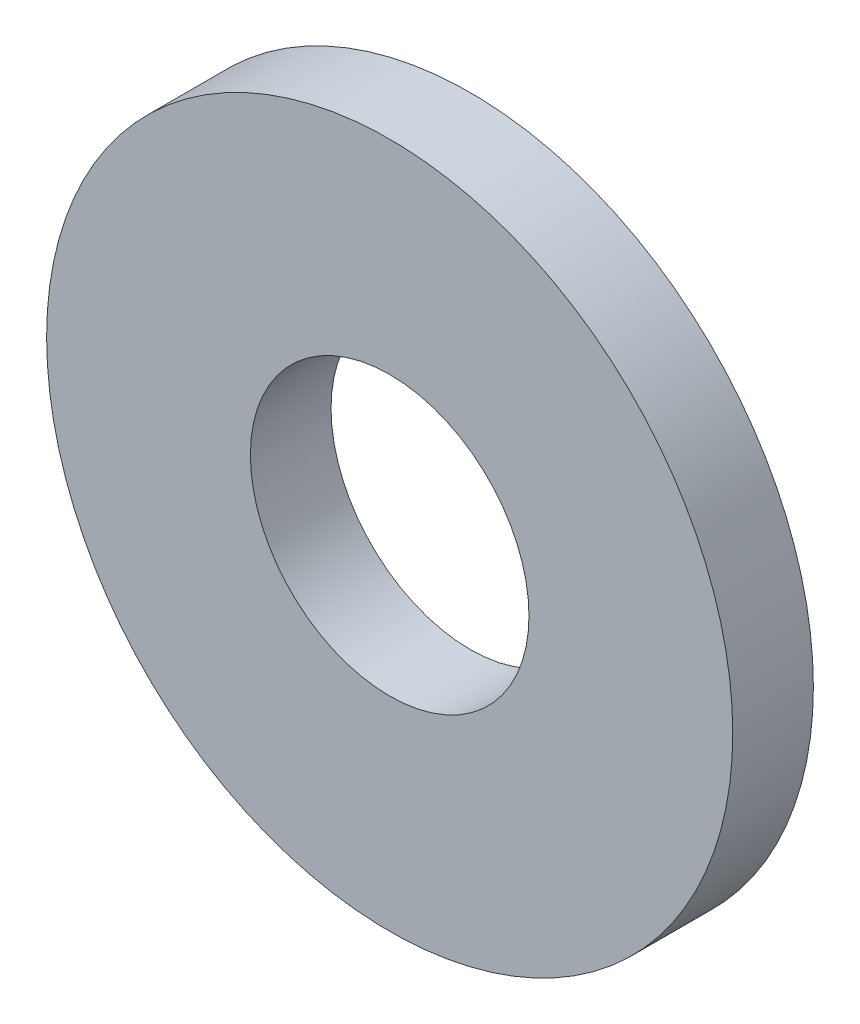
ISO-10303-21;
HEADER;
FILE_DESCRIPTION(('STEP AP214'),'2;1');
FILE_NAME('part.step','',(''),(''),'','','');
FILE_SCHEMA(('AUTOMOTIVE_DESIGN { 1 0 10303 214 1 1 1 1 }'));
ENDSEC;
DATA;
#1=APPLICATION_CONTEXT('core data for automotive mechanical design processes');
#2=APPLICATION_PROTOCOL_DEFINITION('international standard','automotive_design',2000,#1);
#3=PRODUCT_CONTEXT('',#1,'mechanical');
#4=PRODUCT('Part','Part','',(#3));
#5=PRODUCT_RELATED_PRODUCT_CATEGORY('part','',(#4));
#6=PRODUCT_DEFINITION_FORMATION('','',#4);
#7=PRODUCT_DEFINITION_CONTEXT('part definition',#1,'design');
#8=PRODUCT_DEFINITION('design','',#6,#7);
#9=PRODUCT_DEFINITION_SHAPE('','',#8);
#10=(LENGTH_UNIT() NAMED_UNIT(*) SI_UNIT(.MILLI.,.METRE.));
#11=(NAMED_UNIT(*) PLANE_ANGLE_UNIT() SI_UNIT($,.RADIAN.));
#12=(NAMED_UNIT(*) SI_UNIT($,.STERADIAN.) SOLID_ANGLE_UNIT());
#13=UNCERTAINTY_MEASURE_WITH_UNIT(LENGTH_MEASURE(1.E-05),#10,'distance_accuracy_value','');
#14=(GEOMETRIC_REPRESENTATION_CONTEXT(3) GLOBAL_UNCERTAINTY_ASSIGNED_CONTEXT((#13)) GLOBAL_UNIT_ASSIGNED_CONTEXT((#10,
#11,#12)) REPRESENTATION_CONTEXT('',''));
#15=CARTESIAN_POINT('',(0.,0.,0.));
#16=DIRECTION('',(0.,0.,1.));
#17=DIRECTION('',(1.,0.,0.));
#18=AXIS2_PLACEMENT_3D('',#15,#16,#17);
#19=CARTESIAN_POINT('',(0.,0.,1.49225));
#20=DIRECTION('',(0.,0.,1.));
#21=DIRECTION('',(1.,0.,0.));
#22=AXIS2_PLACEMENT_3D('',#19,#20,#21);
#23=PLANE('',#22);
#24=CARTESIAN_POINT('',(0.,0.,1.49225));
#25=DIRECTION('',(0.,0.,1.));
#26=DIRECTION('',(1.,0.,0.));
#27=AXIS2_PLACEMENT_3D('',#24,#25,#26);
#28=CIRCLE('',#27,12.7);
#29=CARTESIAN_POINT('',(12.7,0.,1.49225));
#30=VERTEX_POINT('',#29);
#31=EDGE_CURVE('E10',#30,#30,#28,.T.);
#32=ORIENTED_EDGE('',*,*,#31,.T.);
#33=EDGE_LOOP('',(#32));
#34=FACE_BOUND('',#33,.T.);
#35=CARTESIAN_POINT('',(0.,0.,1.49225));
#36=DIRECTION('',(0.,0.,1.));
#37=DIRECTION('',(1.,0.,0.));
#38=AXIS2_PLACEMENT_3D('',#35,#36,#37);
#39=CIRCLE('',#38,5.1562);
#40=CARTESIAN_POINT('',(5.1562,0.,1.49225));
#41=VERTEX_POINT('',#40);
#42=EDGE_CURVE('E44',#41,#41,#39,.T.);
#43=ORIENTED_EDGE('',*,*,#42,.F.);
#44=EDGE_LOOP('',(#43));
#45=FACE_BOUND('',#44,.T.);
#46=ADVANCED_FACE('F33',(#34,#45),#23,.T.);
#47=CARTESIAN_POINT('',(0.,0.,-1.49225));
#48=DIRECTION('',(0.,0.,1.));
#49=DIRECTION('',(1.,0.,0.));
#50=AXIS2_PLACEMENT_3D('',#47,#48,#49);
#51=PLANE('',#50);
#52=CARTESIAN_POINT('',(0.,0.,-1.49225));
#53=DIRECTION('',(0.,0.,1.));
#54=DIRECTION('',(1.,0.,0.));
#55=AXIS2_PLACEMENT_3D('',#52,#53,#54);
#56=CIRCLE('',#55,12.7);
#57=CARTESIAN_POINT('',(12.7,0.,-1.49225));
#58=VERTEX_POINT('',#57);
#59=EDGE_CURVE('E37',#58,#58,#56,.T.);
#60=ORIENTED_EDGE('',*,*,#59,.F.);
#61=EDGE_LOOP('',(#60));
#62=FACE_BOUND('',#61,.T.);
#63=CARTESIAN_POINT('',(0.,0.,-1.49225));
#64=DIRECTION('',(0.,0.,1.));
#65=DIRECTION('',(1.,0.,0.));
#66=AXIS2_PLACEMENT_3D('',#63,#64,#65);
#67=CIRCLE('',#66,5.1562);
#68=CARTESIAN_POINT('',(5.1562,0.,-1.49225));
#69=VERTEX_POINT('',#68);
#70=EDGE_CURVE('E46',#69,#69,#67,.T.);
#71=ORIENTED_EDGE('',*,*,#70,.T.);
#72=EDGE_LOOP('',(#71));
#73=FACE_BOUND('',#72,.T.);
#74=ADVANCED_FACE('F56',(#62,#73),#51,.F.);
#75=CARTESIAN_POINT('',(0.,0.,1.49225));
#76=DIRECTION('',(0.,0.,-1.));
#77=DIRECTION('',(-1.,0.,0.));
#78=AXIS2_PLACEMENT_3D('',#75,#76,#77);
#79=CYLINDRICAL_SURFACE('',#78,12.7);
#80=ORIENTED_EDGE('',*,*,#31,.F.);
#81=EDGE_LOOP('',(#80));
#82=FACE_BOUND('',#81,.T.);
#83=ORIENTED_EDGE('',*,*,#59,.T.);
#84=EDGE_LOOP('',(#83));
#85=FACE_BOUND('',#84,.T.);
#86=ADVANCED_FACE('F35',(#82,#85),#79,.T.);
#87=CARTESIAN_POINT('',(0.,0.,1.49225));
#88=DIRECTION('',(0.,0.,-1.));
#89=DIRECTION('',(-1.,0.,0.));
#90=AXIS2_PLACEMENT_3D('',#87,#88,#89);
#91=CYLINDRICAL_SURFACE('',#90,5.1562);
#92=ORIENTED_EDGE('',*,*,#42,.T.);
#93=EDGE_LOOP('',(#92));
#94=FACE_BOUND('',#93,.T.);
#95=ORIENTED_EDGE('',*,*,#70,.F.);
#96=EDGE_LOOP('',(#95));
#97=FACE_BOUND('',#96,.T.);
#98=ADVANCED_FACE('F52',(#94,#97),#91,.F.);
#99=CLOSED_SHELL('',(#46,#74,#86,#98));
#100=MANIFOLD_SOLID_BREP('B2',#99);
#101=ADVANCED_BREP_SHAPE_REPRESENTATION('',(#18,#100),#14);
#102=SHAPE_DEFINITION_REPRESENTATION(#9,#101);
ENDSEC;
END-ISO-10303-21;
